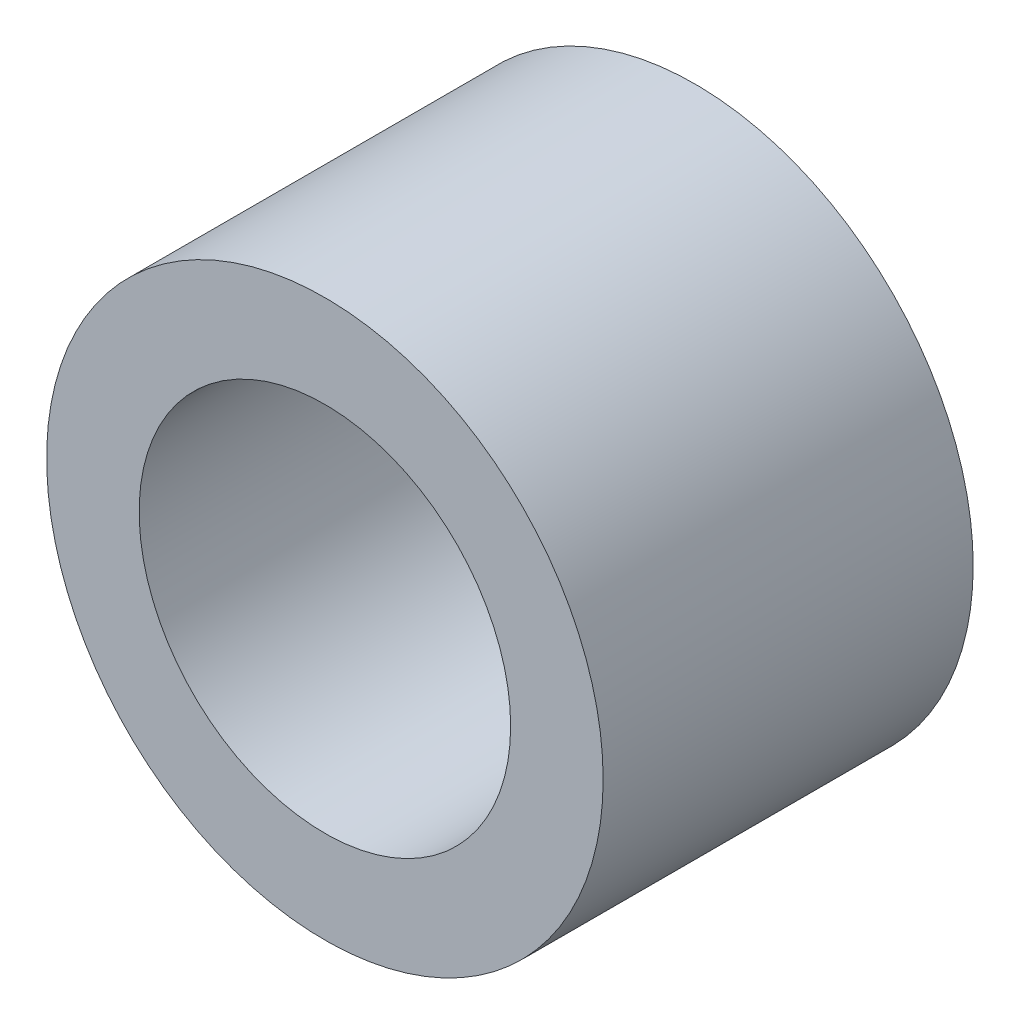
ISO-10303-21;
HEADER;
FILE_DESCRIPTION(('STEP AP214'),'2;1');
FILE_NAME('part.step','',(''),(''),'','','');
FILE_SCHEMA(('AUTOMOTIVE_DESIGN { 1 0 10303 214 1 1 1 1 }'));
ENDSEC;
DATA;
#1=APPLICATION_CONTEXT('core data for automotive mechanical design processes');
#2=APPLICATION_PROTOCOL_DEFINITION('international standard','automotive_design',2000,#1);
#3=PRODUCT_CONTEXT('',#1,'mechanical');
#4=PRODUCT('Part','Part','',(#3));
#5=PRODUCT_RELATED_PRODUCT_CATEGORY('part','',(#4));
#6=PRODUCT_DEFINITION_FORMATION('','',#4);
#7=PRODUCT_DEFINITION_CONTEXT('part definition',#1,'design');
#8=PRODUCT_DEFINITION('design','',#6,#7);
#9=PRODUCT_DEFINITION_SHAPE('','',#8);
#10=(LENGTH_UNIT() NAMED_UNIT(*) SI_UNIT(.MILLI.,.METRE.));
#11=(NAMED_UNIT(*) PLANE_ANGLE_UNIT() SI_UNIT($,.RADIAN.));
#12=(NAMED_UNIT(*) SI_UNIT($,.STERADIAN.) SOLID_ANGLE_UNIT());
#13=UNCERTAINTY_MEASURE_WITH_UNIT(LENGTH_MEASURE(1.E-05),#10,'distance_accuracy_value','');
#14=(GEOMETRIC_REPRESENTATION_CONTEXT(3) GLOBAL_UNCERTAINTY_ASSIGNED_CONTEXT((#13)) GLOBAL_UNIT_ASSIGNED_CONTEXT((#10,
#11,#12)) REPRESENTATION_CONTEXT('',''));
#15=CARTESIAN_POINT('',(0.,0.,0.));
#16=DIRECTION('',(0.,0.,1.));
#17=DIRECTION('',(1.,0.,0.));
#18=AXIS2_PLACEMENT_3D('',#15,#16,#17);
#19=CARTESIAN_POINT('',(0.,0.,3.175));
#20=DIRECTION('',(0.,0.,1.));
#21=DIRECTION('',(1.,0.,0.));
#22=AXIS2_PLACEMENT_3D('',#19,#20,#21);
#23=PLANE('',#22);
#24=CARTESIAN_POINT('',(0.,0.,3.175));
#25=DIRECTION('',(0.,0.,1.));
#26=DIRECTION('',(1.,0.,0.));
#27=AXIS2_PLACEMENT_3D('',#24,#25,#26);
#28=CIRCLE('',#27,4.7752);
#29=CARTESIAN_POINT('',(4.7752,0.,3.175));
#30=VERTEX_POINT('',#29);
#31=EDGE_CURVE('E10',#30,#30,#28,.T.);
#32=ORIENTED_EDGE('',*,*,#31,.T.);
#33=EDGE_LOOP('',(#32));
#34=FACE_BOUND('',#33,.T.);
#35=CARTESIAN_POINT('',(0.,0.,3.175));
#36=DIRECTION('',(0.,0.,1.));
#37=DIRECTION('',(1.,0.,0.));
#38=AXIS2_PLACEMENT_3D('',#35,#36,#37);
#39=CIRCLE('',#38,3.1877);
#40=CARTESIAN_POINT('',(3.1877,0.,3.175));
#41=VERTEX_POINT('',#40);
#42=EDGE_CURVE('E53',#41,#41,#39,.T.);
#43=ORIENTED_EDGE('',*,*,#42,.F.);
#44=EDGE_LOOP('',(#43));
#45=FACE_BOUND('',#44,.T.);
#46=ADVANCED_FACE('F39',(#34,#45),#23,.T.);
#47=CARTESIAN_POINT('',(0.,0.,-3.175));
#48=DIRECTION('',(0.,0.,1.));
#49=DIRECTION('',(1.,0.,0.));
#50=AXIS2_PLACEMENT_3D('',#47,#48,#49);
#51=PLANE('',#50);
#52=CARTESIAN_POINT('',(0.,0.,-3.175));
#53=DIRECTION('',(0.,0.,1.));
#54=DIRECTION('',(1.,0.,0.));
#55=AXIS2_PLACEMENT_3D('',#52,#53,#54);
#56=CIRCLE('',#55,4.7752);
#57=CARTESIAN_POINT('',(4.7752,0.,-3.175));
#58=VERTEX_POINT('',#57);
#59=EDGE_CURVE('E43',#58,#58,#56,.T.);
#60=ORIENTED_EDGE('',*,*,#59,.F.);
#61=EDGE_LOOP('',(#60));
#62=FACE_BOUND('',#61,.T.);
#63=CARTESIAN_POINT('',(0.,0.,-3.175));
#64=DIRECTION('',(0.,0.,1.));
#65=DIRECTION('',(1.,0.,0.));
#66=AXIS2_PLACEMENT_3D('',#63,#64,#65);
#67=CIRCLE('',#66,3.1877);
#68=CARTESIAN_POINT('',(3.1877,0.,-3.175));
#69=VERTEX_POINT('',#68);
#70=EDGE_CURVE('E55',#69,#69,#67,.T.);
#71=ORIENTED_EDGE('',*,*,#70,.T.);
#72=EDGE_LOOP('',(#71));
#73=FACE_BOUND('',#72,.T.);
#74=ADVANCED_FACE('F68',(#62,#73),#51,.F.);
#75=CARTESIAN_POINT('',(0.,0.,3.175));
#76=DIRECTION('',(0.,0.,-1.));
#77=DIRECTION('',(-1.,0.,0.));
#78=AXIS2_PLACEMENT_3D('',#75,#76,#77);
#79=CYLINDRICAL_SURFACE('',#78,4.7752);
#80=ORIENTED_EDGE('',*,*,#31,.F.);
#81=EDGE_LOOP('',(#80));
#82=FACE_BOUND('',#81,.T.);
#83=ORIENTED_EDGE('',*,*,#59,.T.);
#84=EDGE_LOOP('',(#83));
#85=FACE_BOUND('',#84,.T.);
#86=ADVANCED_FACE('F41',(#82,#85),#79,.T.);
#87=CARTESIAN_POINT('',(0.,0.,3.175));
#88=DIRECTION('',(0.,0.,-1.));
#89=DIRECTION('',(-1.,0.,0.));
#90=AXIS2_PLACEMENT_3D('',#87,#88,#89);
#91=CYLINDRICAL_SURFACE('',#90,3.1877);
#92=ORIENTED_EDGE('',*,*,#42,.T.);
#93=EDGE_LOOP('',(#92));
#94=FACE_BOUND('',#93,.T.);
#95=ORIENTED_EDGE('',*,*,#70,.F.);
#96=EDGE_LOOP('',(#95));
#97=FACE_BOUND('',#96,.T.);
#98=ADVANCED_FACE('F64',(#94,#97),#91,.F.);
#99=CLOSED_SHELL('',(#46,#74,#86,#98));
#100=MANIFOLD_SOLID_BREP('B2',#99);
#101=ADVANCED_BREP_SHAPE_REPRESENTATION('',(#18,#100),#14);
#102=SHAPE_DEFINITION_REPRESENTATION(#9,#101);
ENDSEC;
END-ISO-10303-21;
